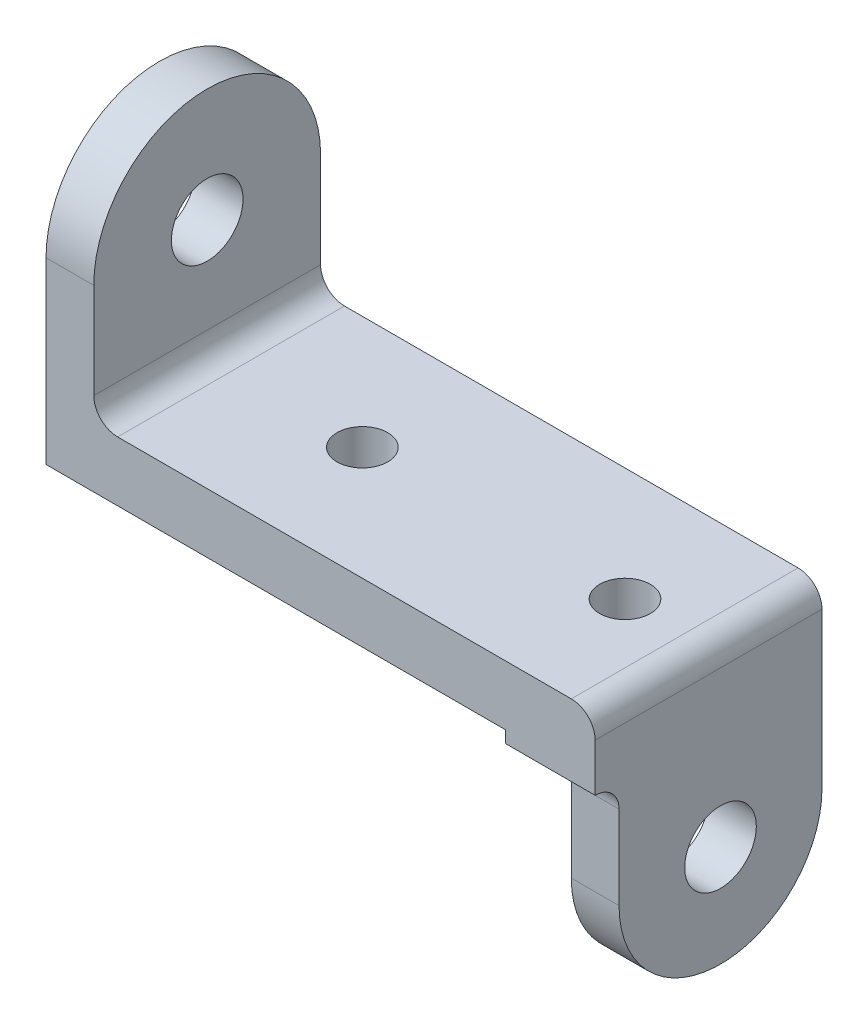
ISO-10303-21;
HEADER;
FILE_DESCRIPTION(('STEP AP214'),'2;1');
FILE_NAME('part.step','',(''),(''),'','','');
FILE_SCHEMA(('AUTOMOTIVE_DESIGN { 1 0 10303 214 1 1 1 1 }'));
ENDSEC;
DATA;
#1=APPLICATION_CONTEXT('core data for automotive mechanical design processes');
#2=APPLICATION_PROTOCOL_DEFINITION('international standard','automotive_design',2000,#1);
#3=PRODUCT_CONTEXT('',#1,'mechanical');
#4=PRODUCT('Part','Part','',(#3));
#5=PRODUCT_RELATED_PRODUCT_CATEGORY('part','',(#4));
#6=PRODUCT_DEFINITION_FORMATION('','',#4);
#7=PRODUCT_DEFINITION_CONTEXT('part definition',#1,'design');
#8=PRODUCT_DEFINITION('design','',#6,#7);
#9=PRODUCT_DEFINITION_SHAPE('','',#8);
#10=(LENGTH_UNIT() NAMED_UNIT(*) SI_UNIT(.MILLI.,.METRE.));
#11=(NAMED_UNIT(*) PLANE_ANGLE_UNIT() SI_UNIT($,.RADIAN.));
#12=(NAMED_UNIT(*) SI_UNIT($,.STERADIAN.) SOLID_ANGLE_UNIT());
#13=UNCERTAINTY_MEASURE_WITH_UNIT(LENGTH_MEASURE(1.E-05),#10,'distance_accuracy_value','');
#14=(GEOMETRIC_REPRESENTATION_CONTEXT(3) GLOBAL_UNCERTAINTY_ASSIGNED_CONTEXT((#13)) GLOBAL_UNIT_ASSIGNED_CONTEXT((#10,
#11,#12)) REPRESENTATION_CONTEXT('',''));
#15=CARTESIAN_POINT('',(0.,0.,0.));
#16=DIRECTION('',(0.,0.,1.));
#17=DIRECTION('',(1.,0.,0.));
#18=AXIS2_PLACEMENT_3D('',#15,#16,#17);
#19=CARTESIAN_POINT('',(122.2375,0.,0.));
#20=DIRECTION('',(1.,0.,0.));
#21=DIRECTION('',(0.,0.,-1.));
#22=AXIS2_PLACEMENT_3D('',#19,#20,#21);
#23=PLANE('',#22);
#24=DIRECTION('',(0.,-0.00487811092438263,0.999988101946123));
#25=VECTOR('',#24,1.);
#26=CARTESIAN_POINT('',(122.2375,-5.0566552119598,-0.0246672185221924));
#27=LINE('',#26,#25);
#28=CARTESIAN_POINT('',(122.2375,-4.7625,-60.325));
#29=VERTEX_POINT('',#28);
#30=CARTESIAN_POINT('',(122.2375,-4.87764941655943,-36.7199511828625));
#31=VERTEX_POINT('',#30);
#32=EDGE_CURVE('E242',#29,#31,#27,.T.);
#33=ORIENTED_EDGE('',*,*,#32,.T.);
#34=DIRECTION('',(0.,1.,0.));
#35=VECTOR('',#34,1.);
#36=CARTESIAN_POINT('',(122.2375,-58.7375,-36.7199511828625));
#37=LINE('',#36,#35);
#38=CARTESIAN_POINT('',(122.2375,0.,-36.7199511828625));
#39=VERTEX_POINT('',#38);
#40=EDGE_CURVE('E11',#31,#39,#37,.T.);
#41=ORIENTED_EDGE('',*,*,#40,.T.);
#42=DIRECTION('',(0.,0.,-1.));
#43=VECTOR('',#42,1.);
#44=CARTESIAN_POINT('',(122.2375,0.,0.));
#45=LINE('',#44,#43);
#46=CARTESIAN_POINT('',(122.2375,0.,-60.325));
#47=VERTEX_POINT('',#46);
#48=EDGE_CURVE('E159',#39,#47,#45,.T.);
#49=ORIENTED_EDGE('',*,*,#48,.T.);
#50=DIRECTION('',(0.,-1.,0.));
#51=VECTOR('',#50,1.);
#52=CARTESIAN_POINT('',(122.2375,0.,-60.325));
#53=LINE('',#52,#51);
#54=EDGE_CURVE('E181',#47,#29,#53,.T.);
#55=ORIENTED_EDGE('',*,*,#54,.T.);
#56=EDGE_LOOP('',(#33,#41,#49,#55));
#57=FACE_BOUND('',#56,.T.);
#58=ADVANCED_FACE('F34',(#57),#23,.F.);
#59=CARTESIAN_POINT('',(146.05,-5.0566552119598,-0.0246672185221924));
#60=DIRECTION('',(0.,-0.999988101946123,-0.00487811092438263));
#61=DIRECTION('',(0.,0.00487811092438263,-0.999988101946123));
#62=AXIS2_PLACEMENT_3D('',#59,#60,#61);
#63=PLANE('',#62);
#64=CARTESIAN_POINT('',(123.825,-4.90963777140983,-30.1625));
#65=DIRECTION('',(0.,-0.999988101946123,-0.00487811092438263));
#66=DIRECTION('',(0.,0.00487811092438263,-0.999988101946123));
#67=AXIS2_PLACEMENT_3D('',#64,#65,#66);
#68=ELLIPSE('',#67,6.74695527563738,6.74687500000001);
#69=CARTESIAN_POINT('',(122.2375,-4.94162612626022,-23.6050488171375));
#70=VERTEX_POINT('',#69);
#71=EDGE_CURVE('E49',#31,#70,#68,.T.);
#72=ORIENTED_EDGE('',*,*,#71,.F.);
#73=ORIENTED_EDGE('',*,*,#32,.F.);
#74=DIRECTION('',(-1.,0.,0.));
#75=VECTOR('',#74,1.);
#76=CARTESIAN_POINT('',(146.05,-4.7625,-60.325));
#77=LINE('',#76,#75);
#78=CARTESIAN_POINT('',(133.35,-4.7625,-60.325));
#79=VERTEX_POINT('',#78);
#80=EDGE_CURVE('E255',#79,#29,#77,.T.);
#81=ORIENTED_EDGE('',*,*,#80,.F.);
#82=DIRECTION('',(0.,-0.00487811092438263,0.999988101946123));
#83=VECTOR('',#82,1.);
#84=CARTESIAN_POINT('',(133.35,-5.0566552119598,-0.0246672185221924));
#85=LINE('',#84,#83);
#86=CARTESIAN_POINT('',(133.35,-5.03487193946542,-4.49012806053458));
#87=VERTEX_POINT('',#86);
#88=EDGE_CURVE('E208',#79,#87,#85,.T.);
#89=ORIENTED_EDGE('',*,*,#88,.T.);
#90=DIRECTION('',(-1.,0.,0.));
#91=VECTOR('',#90,1.);
#92=CARTESIAN_POINT('',(146.05,-5.03487193946542,-4.49012806053458));
#93=LINE('',#92,#91);
#94=CARTESIAN_POINT('',(122.2375,-5.03487193946542,-4.49012806053458));
#95=VERTEX_POINT('',#94);
#96=EDGE_CURVE('E170',#87,#95,#93,.T.);
#97=ORIENTED_EDGE('',*,*,#96,.T.);
#98=EDGE_CURVE('E241',#70,#95,#27,.T.);
#99=ORIENTED_EDGE('',*,*,#98,.F.);
#100=EDGE_LOOP('',(#72,#73,#81,#89,#97,#99));
#101=FACE_BOUND('',#100,.T.);
#102=ADVANCED_FACE('F298',(#101),#63,.T.);
#103=CARTESIAN_POINT('',(12.7,0.,-60.325));
#104=DIRECTION('',(0.,0.,1.));
#105=DIRECTION('',(1.,0.,0.));
#106=AXIS2_PLACEMENT_3D('',#103,#104,#105);
#107=PLANE('',#106);
#108=DIRECTION('',(-1.,0.,0.));
#109=VECTOR('',#108,1.);
#110=CARTESIAN_POINT('',(122.2375,15.875,-60.325));
#111=LINE('',#110,#109);
#112=CARTESIAN_POINT('',(139.7,15.875,-60.325));
#113=VERTEX_POINT('',#112);
#114=CARTESIAN_POINT('',(19.05,15.875,-60.325));
#115=VERTEX_POINT('',#114);
#116=EDGE_CURVE('E168',#113,#115,#111,.T.);
#117=ORIENTED_EDGE('',*,*,#116,.F.);
#118=CARTESIAN_POINT('',(139.7,9.525,-60.325));
#119=DIRECTION('',(0.,0.,1.));
#120=DIRECTION('',(1.,0.,0.));
#121=AXIS2_PLACEMENT_3D('',#118,#119,#120);
#122=CIRCLE('',#121,6.35);
#123=CARTESIAN_POINT('',(146.05,9.525,-60.325));
#124=VERTEX_POINT('',#123);
#125=EDGE_CURVE('E193',#113,#124,#122,.F.);
#126=ORIENTED_EDGE('',*,*,#125,.T.);
#127=DIRECTION('',(0.,-1.,0.));
#128=VECTOR('',#127,1.);
#129=CARTESIAN_POINT('',(146.05,0.,-60.325));
#130=LINE('',#129,#128);
#131=CARTESIAN_POINT('',(146.05,-31.75,-60.325));
#132=VERTEX_POINT('',#131);
#133=EDGE_CURVE('E235',#124,#132,#130,.T.);
#134=ORIENTED_EDGE('',*,*,#133,.T.);
#135=DIRECTION('',(-1.,0.,0.));
#136=VECTOR('',#135,1.);
#137=CARTESIAN_POINT('',(146.05,-31.75,-60.325));
#138=LINE('',#137,#136);
#139=CARTESIAN_POINT('',(133.35,-31.75,-60.325));
#140=VERTEX_POINT('',#139);
#141=EDGE_CURVE('E223',#132,#140,#138,.T.);
#142=ORIENTED_EDGE('',*,*,#141,.T.);
#143=DIRECTION('',(0.,-1.,0.));
#144=VECTOR('',#143,1.);
#145=CARTESIAN_POINT('',(133.35,0.,-60.325));
#146=LINE('',#145,#144);
#147=EDGE_CURVE('E205',#79,#140,#146,.T.);
#148=ORIENTED_EDGE('',*,*,#147,.F.);
#149=ORIENTED_EDGE('',*,*,#80,.T.);
#150=ORIENTED_EDGE('',*,*,#54,.F.);
#151=DIRECTION('',(-1.,0.,0.));
#152=VECTOR('',#151,1.);
#153=CARTESIAN_POINT('',(12.7,0.,-60.325));
#154=LINE('',#153,#152);
#155=CARTESIAN_POINT('',(0.,0.,-60.325));
#156=VERTEX_POINT('',#155);
#157=EDGE_CURVE('E177',#47,#156,#154,.T.);
#158=ORIENTED_EDGE('',*,*,#157,.T.);
#159=DIRECTION('',(0.,1.,0.));
#160=VECTOR('',#159,1.);
#161=CARTESIAN_POINT('',(0.,0.,-60.325));
#162=LINE('',#161,#160);
#163=CARTESIAN_POINT('',(0.,47.625,-60.325));
#164=VERTEX_POINT('',#163);
#165=EDGE_CURVE('E368',#156,#164,#162,.T.);
#166=ORIENTED_EDGE('',*,*,#165,.T.);
#167=DIRECTION('',(-1.,0.,0.));
#168=VECTOR('',#167,1.);
#169=CARTESIAN_POINT('',(12.7,47.625,-60.325));
#170=LINE('',#169,#168);
#171=CARTESIAN_POINT('',(12.7,47.625,-60.325));
#172=VERTEX_POINT('',#171);
#173=EDGE_CURVE('E175',#172,#164,#170,.T.);
#174=ORIENTED_EDGE('',*,*,#173,.F.);
#175=DIRECTION('',(0.,1.,0.));
#176=VECTOR('',#175,1.);
#177=CARTESIAN_POINT('',(12.7,0.,-60.325));
#178=LINE('',#177,#176);
#179=CARTESIAN_POINT('',(12.7,22.225,-60.325));
#180=VERTEX_POINT('',#179);
#181=EDGE_CURVE('E362',#180,#172,#178,.T.);
#182=ORIENTED_EDGE('',*,*,#181,.F.);
#183=CARTESIAN_POINT('',(19.05,22.225,-60.325));
#184=DIRECTION('',(0.,0.,1.));
#185=DIRECTION('',(1.,0.,0.));
#186=AXIS2_PLACEMENT_3D('',#183,#184,#185);
#187=CIRCLE('',#186,6.35);
#188=EDGE_CURVE('E151',#180,#115,#187,.T.);
#189=ORIENTED_EDGE('',*,*,#188,.T.);
#190=EDGE_LOOP('',(#117,#126,#134,#142,#148,#149,#150,#158,#166,#174,#182,#189));
#191=FACE_BOUND('',#190,.T.);
#192=ADVANCED_FACE('F304',(#191),#107,.F.);
#193=CARTESIAN_POINT('',(12.7,47.625,-30.1625));
#194=DIRECTION('',(-1.,0.,0.));
#195=DIRECTION('',(0.,0.,1.));
#196=AXIS2_PLACEMENT_3D('',#193,#194,#195);
#197=CYLINDRICAL_SURFACE('',#196,30.1625);
#198=CARTESIAN_POINT('',(0.,47.625,-30.1625));
#199=DIRECTION('',(1.,0.,0.));
#200=DIRECTION('',(0.,0.,-1.));
#201=AXIS2_PLACEMENT_3D('',#198,#199,#200);
#202=CIRCLE('',#201,30.1625);
#203=CARTESIAN_POINT('',(0.,47.625,0.));
#204=VERTEX_POINT('',#203);
#205=EDGE_CURVE('E382',#164,#204,#202,.T.);
#206=ORIENTED_EDGE('',*,*,#205,.T.);
#207=DIRECTION('',(-1.,0.,0.));
#208=VECTOR('',#207,1.);
#209=CARTESIAN_POINT('',(12.7,47.625,0.));
#210=LINE('',#209,#208);
#211=CARTESIAN_POINT('',(12.7,47.625,0.));
#212=VERTEX_POINT('',#211);
#213=EDGE_CURVE('E387',#212,#204,#210,.T.);
#214=ORIENTED_EDGE('',*,*,#213,.F.);
#215=CARTESIAN_POINT('',(12.7,47.625,-30.1625));
#216=DIRECTION('',(1.,0.,0.));
#217=DIRECTION('',(0.,0.,-1.));
#218=AXIS2_PLACEMENT_3D('',#215,#216,#217);
#219=CIRCLE('',#218,30.1625);
#220=EDGE_CURVE('E376',#172,#212,#219,.T.);
#221=ORIENTED_EDGE('',*,*,#220,.F.);
#222=ORIENTED_EDGE('',*,*,#173,.T.);
#223=EDGE_LOOP('',(#206,#214,#221,#222));
#224=FACE_BOUND('',#223,.T.);
#225=ADVANCED_FACE('F334',(#224),#197,.T.);
#226=CARTESIAN_POINT('',(12.7,0.,0.));
#227=DIRECTION('',(0.,0.,1.));
#228=DIRECTION('',(0.,-1.,0.));
#229=AXIS2_PLACEMENT_3D('',#226,#227,#228);
#230=PLANE('',#229);
#231=DIRECTION('',(0.,-1.,0.));
#232=VECTOR('',#231,1.);
#233=CARTESIAN_POINT('',(146.05,0.,0.));
#234=LINE('',#233,#232);
#235=CARTESIAN_POINT('',(146.05,9.525,0.));
#236=VERTEX_POINT('',#235);
#237=CARTESIAN_POINT('',(146.05,-3.175,0.));
#238=VERTEX_POINT('',#237);
#239=EDGE_CURVE('E237',#236,#238,#234,.T.);
#240=ORIENTED_EDGE('',*,*,#239,.F.);
#241=CARTESIAN_POINT('',(139.7,9.525,0.));
#242=DIRECTION('',(0.,0.,1.));
#243=DIRECTION('',(0.,-1.,0.));
#244=AXIS2_PLACEMENT_3D('',#241,#242,#243);
#245=CIRCLE('',#244,6.35);
#246=CARTESIAN_POINT('',(139.7,15.875,0.));
#247=VERTEX_POINT('',#246);
#248=EDGE_CURVE('E190',#236,#247,#245,.T.);
#249=ORIENTED_EDGE('',*,*,#248,.T.);
#250=DIRECTION('',(-1.,0.,0.));
#251=VECTOR('',#250,1.);
#252=CARTESIAN_POINT('',(122.2375,15.875,0.));
#253=LINE('',#252,#251);
#254=CARTESIAN_POINT('',(19.05,15.875,0.));
#255=VERTEX_POINT('',#254);
#256=EDGE_CURVE('E165',#247,#255,#253,.T.);
#257=ORIENTED_EDGE('',*,*,#256,.T.);
#258=CARTESIAN_POINT('',(19.05,22.225,0.));
#259=DIRECTION('',(0.,0.,1.));
#260=DIRECTION('',(0.,-1.,0.));
#261=AXIS2_PLACEMENT_3D('',#258,#259,#260);
#262=CIRCLE('',#261,6.35);
#263=CARTESIAN_POINT('',(12.7,22.225,0.));
#264=VERTEX_POINT('',#263);
#265=EDGE_CURVE('E188',#255,#264,#262,.F.);
#266=ORIENTED_EDGE('',*,*,#265,.T.);
#267=DIRECTION('',(0.,1.,0.));
#268=VECTOR('',#267,1.);
#269=CARTESIAN_POINT('',(12.7,0.,0.));
#270=LINE('',#269,#268);
#271=EDGE_CURVE('E379',#264,#212,#270,.T.);
#272=ORIENTED_EDGE('',*,*,#271,.T.);
#273=ORIENTED_EDGE('',*,*,#213,.T.);
#274=DIRECTION('',(0.,1.,0.));
#275=VECTOR('',#274,1.);
#276=CARTESIAN_POINT('',(0.,0.,0.));
#277=LINE('',#276,#275);
#278=CARTESIAN_POINT('',(0.,0.,0.));
#279=VERTEX_POINT('',#278);
#280=EDGE_CURVE('E385',#279,#204,#277,.T.);
#281=ORIENTED_EDGE('',*,*,#280,.F.);
#282=DIRECTION('',(-1.,0.,0.));
#283=VECTOR('',#282,1.);
#284=CARTESIAN_POINT('',(12.7,0.,0.));
#285=LINE('',#284,#283);
#286=CARTESIAN_POINT('',(122.2375,0.,0.));
#287=VERTEX_POINT('',#286);
#288=EDGE_CURVE('E389',#287,#279,#285,.T.);
#289=ORIENTED_EDGE('',*,*,#288,.F.);
#290=DIRECTION('',(0.,-1.,0.));
#291=VECTOR('',#290,1.);
#292=CARTESIAN_POINT('',(122.2375,0.,0.));
#293=LINE('',#292,#291);
#294=CARTESIAN_POINT('',(122.2375,-3.175,0.));
#295=VERTEX_POINT('',#294);
#296=EDGE_CURVE('E164',#287,#295,#293,.T.);
#297=ORIENTED_EDGE('',*,*,#296,.T.);
#298=DIRECTION('',(-1.,0.,0.));
#299=VECTOR('',#298,1.);
#300=CARTESIAN_POINT('',(146.05,-3.175,0.));
#301=LINE('',#300,#299);
#302=EDGE_CURVE('E239',#238,#295,#301,.T.);
#303=ORIENTED_EDGE('',*,*,#302,.F.);
#304=EDGE_LOOP('',(#240,#249,#257,#266,#272,#273,#281,#289,#297,#303));
#305=FACE_BOUND('',#304,.T.);
#306=ADVANCED_FACE('F331',(#305),#230,.T.);
#307=CARTESIAN_POINT('',(12.7,47.625,-30.1625));
#308=DIRECTION('',(-1.,0.,0.));
#309=DIRECTION('',(0.,0.,1.));
#310=AXIS2_PLACEMENT_3D('',#307,#308,#309);
#311=CYLINDRICAL_SURFACE('',#310,9.52500000000001);
#312=CARTESIAN_POINT('',(12.7,47.625,-30.1625));
#313=DIRECTION('',(1.,0.,0.));
#314=DIRECTION('',(0.,0.,-1.));
#315=AXIS2_PLACEMENT_3D('',#312,#313,#314);
#316=CIRCLE('',#315,9.52500000000001);
#317=CARTESIAN_POINT('',(12.7,47.625,-39.6875));
#318=VERTEX_POINT('',#317);
#319=EDGE_CURVE('E371',#318,#318,#316,.T.);
#320=ORIENTED_EDGE('',*,*,#319,.T.);
#321=EDGE_LOOP('',(#320));
#322=FACE_BOUND('',#321,.T.);
#323=CARTESIAN_POINT('',(0.,47.625,-30.1625));
#324=DIRECTION('',(1.,0.,0.));
#325=DIRECTION('',(0.,0.,-1.));
#326=AXIS2_PLACEMENT_3D('',#323,#324,#325);
#327=CIRCLE('',#326,9.52500000000001);
#328=CARTESIAN_POINT('',(0.,47.625,-39.6875));
#329=VERTEX_POINT('',#328);
#330=EDGE_CURVE('E366',#329,#329,#327,.T.);
#331=ORIENTED_EDGE('',*,*,#330,.F.);
#332=EDGE_LOOP('',(#331));
#333=FACE_BOUND('',#332,.T.);
#334=ADVANCED_FACE('F330',(#322,#333),#311,.F.);
#335=CARTESIAN_POINT('',(12.7,0.,0.));
#336=DIRECTION('',(0.,1.,0.));
#337=DIRECTION('',(0.,0.,1.));
#338=AXIS2_PLACEMENT_3D('',#335,#336,#337);
#339=PLANE('',#338);
#340=CARTESIAN_POINT('',(53.975,0.,-30.1625));
#341=DIRECTION('',(0.,1.,0.));
#342=DIRECTION('',(0.,0.,1.));
#343=AXIS2_PLACEMENT_3D('',#340,#341,#342);
#344=CIRCLE('',#343,6.746875);
#345=CARTESIAN_POINT('',(53.975,0.,-23.415625));
#346=VERTEX_POINT('',#345);
#347=EDGE_CURVE('E259',#346,#346,#344,.T.);
#348=ORIENTED_EDGE('',*,*,#347,.T.);
#349=EDGE_LOOP('',(#348));
#350=FACE_BOUND('',#349,.T.);
#351=ORIENTED_EDGE('',*,*,#48,.F.);
#352=CARTESIAN_POINT('',(123.825,0.,-30.1625));
#353=DIRECTION('',(0.,1.,0.));
#354=DIRECTION('',(0.,0.,1.));
#355=AXIS2_PLACEMENT_3D('',#352,#353,#354);
#356=CIRCLE('',#355,6.74687500000001);
#357=CARTESIAN_POINT('',(122.2375,0.,-23.6050488171375));
#358=VERTEX_POINT('',#357);
#359=EDGE_CURVE('E147',#39,#358,#356,.T.);
#360=ORIENTED_EDGE('',*,*,#359,.T.);
#361=EDGE_CURVE('E156',#287,#358,#45,.T.);
#362=ORIENTED_EDGE('',*,*,#361,.F.);
#363=ORIENTED_EDGE('',*,*,#288,.T.);
#364=DIRECTION('',(0.,0.,-1.));
#365=VECTOR('',#364,1.);
#366=CARTESIAN_POINT('',(0.,0.,0.));
#367=LINE('',#366,#365);
#368=EDGE_CURVE('E374',#279,#156,#367,.T.);
#369=ORIENTED_EDGE('',*,*,#368,.T.);
#370=ORIENTED_EDGE('',*,*,#157,.F.);
#371=EDGE_LOOP('',(#351,#360,#362,#363,#369,#370));
#372=FACE_BOUND('',#371,.T.);
#373=ADVANCED_FACE('F155',(#350,#372),#339,.F.);
#374=CARTESIAN_POINT('',(12.7,0.,0.));
#375=DIRECTION('',(1.,0.,0.));
#376=DIRECTION('',(0.,0.,-1.));
#377=AXIS2_PLACEMENT_3D('',#374,#375,#376);
#378=PLANE('',#377);
#379=ORIENTED_EDGE('',*,*,#271,.F.);
#380=DIRECTION('',(0.,0.,1.));
#381=VECTOR('',#380,1.);
#382=CARTESIAN_POINT('',(12.7,22.225,-60.325));
#383=LINE('',#382,#381);
#384=EDGE_CURVE('E195',#264,#180,#383,.F.);
#385=ORIENTED_EDGE('',*,*,#384,.T.);
#386=ORIENTED_EDGE('',*,*,#181,.T.);
#387=ORIENTED_EDGE('',*,*,#220,.T.);
#388=EDGE_LOOP('',(#379,#385,#386,#387));
#389=FACE_BOUND('',#388,.T.);
#390=ORIENTED_EDGE('',*,*,#319,.F.);
#391=EDGE_LOOP('',(#390));
#392=FACE_BOUND('',#391,.T.);
#393=ADVANCED_FACE('F320',(#389,#392),#378,.T.);
#394=CARTESIAN_POINT('',(0.,0.,0.));
#395=DIRECTION('',(1.,0.,0.));
#396=DIRECTION('',(0.,0.,-1.));
#397=AXIS2_PLACEMENT_3D('',#394,#395,#396);
#398=PLANE('',#397);
#399=ORIENTED_EDGE('',*,*,#330,.T.);
#400=EDGE_LOOP('',(#399));
#401=FACE_BOUND('',#400,.T.);
#402=ORIENTED_EDGE('',*,*,#205,.F.);
#403=ORIENTED_EDGE('',*,*,#165,.F.);
#404=ORIENTED_EDGE('',*,*,#368,.F.);
#405=ORIENTED_EDGE('',*,*,#280,.T.);
#406=EDGE_LOOP('',(#402,#403,#404,#405));
#407=FACE_BOUND('',#406,.T.);
#408=ADVANCED_FACE('F313',(#401,#407),#398,.F.);
#409=CARTESIAN_POINT('',(122.2375,15.875,0.));
#410=DIRECTION('',(0.,1.,0.));
#411=DIRECTION('',(0.,0.,1.));
#412=AXIS2_PLACEMENT_3D('',#409,#410,#411);
#413=PLANE('',#412);
#414=CARTESIAN_POINT('',(123.825,15.875,-30.1625));
#415=DIRECTION('',(0.,1.,0.));
#416=DIRECTION('',(0.,0.,1.));
#417=AXIS2_PLACEMENT_3D('',#414,#415,#416);
#418=CIRCLE('',#417,6.74687500000001);
#419=CARTESIAN_POINT('',(123.825,15.875,-23.415625));
#420=VERTEX_POINT('',#419);
#421=EDGE_CURVE('E160',#420,#420,#418,.T.);
#422=ORIENTED_EDGE('',*,*,#421,.F.);
#423=EDGE_LOOP('',(#422));
#424=FACE_BOUND('',#423,.T.);
#425=CARTESIAN_POINT('',(53.975,15.875,-30.1625));
#426=DIRECTION('',(0.,1.,0.));
#427=DIRECTION('',(0.,0.,1.));
#428=AXIS2_PLACEMENT_3D('',#425,#426,#427);
#429=CIRCLE('',#428,6.746875);
#430=CARTESIAN_POINT('',(53.975,15.875,-23.415625));
#431=VERTEX_POINT('',#430);
#432=EDGE_CURVE('E264',#431,#431,#429,.T.);
#433=ORIENTED_EDGE('',*,*,#432,.F.);
#434=EDGE_LOOP('',(#433));
#435=FACE_BOUND('',#434,.T.);
#436=ORIENTED_EDGE('',*,*,#116,.T.);
#437=DIRECTION('',(0.,0.,1.));
#438=VECTOR('',#437,1.);
#439=CARTESIAN_POINT('',(19.05,15.875,0.));
#440=LINE('',#439,#438);
#441=EDGE_CURVE('E197',#115,#255,#440,.T.);
#442=ORIENTED_EDGE('',*,*,#441,.T.);
#443=ORIENTED_EDGE('',*,*,#256,.F.);
#444=DIRECTION('',(0.,0.,-1.));
#445=VECTOR('',#444,1.);
#446=CARTESIAN_POINT('',(139.7,15.875,0.));
#447=LINE('',#446,#445);
#448=EDGE_CURVE('E200',#247,#113,#447,.T.);
#449=ORIENTED_EDGE('',*,*,#448,.T.);
#450=EDGE_LOOP('',(#436,#442,#443,#449));
#451=FACE_BOUND('',#450,.T.);
#452=ADVANCED_FACE('F308',(#424,#435,#451),#413,.T.);
#453=ORIENTED_EDGE('',*,*,#361,.T.);
#454=DIRECTION('',(0.,1.,0.));
#455=VECTOR('',#454,1.);
#456=CARTESIAN_POINT('',(122.2375,-58.7375,-23.6050488171375));
#457=LINE('',#456,#455);
#458=EDGE_CURVE('E42',#358,#70,#457,.F.);
#459=ORIENTED_EDGE('',*,*,#458,.T.);
#460=ORIENTED_EDGE('',*,*,#98,.T.);
#461=CARTESIAN_POINT('',(122.2375,-9.525,0.));
#462=DIRECTION('',(1.,0.,0.));
#463=DIRECTION('',(0.,0.,-1.));
#464=AXIS2_PLACEMENT_3D('',#461,#462,#463);
#465=CIRCLE('',#464,6.35);
#466=EDGE_CURVE('E231',#95,#295,#465,.T.);
#467=ORIENTED_EDGE('',*,*,#466,.T.);
#468=ORIENTED_EDGE('',*,*,#296,.F.);
#469=EDGE_LOOP('',(#453,#459,#460,#467,#468));
#470=FACE_BOUND('',#469,.T.);
#471=ADVANCED_FACE('F162',(#470),#23,.F.);
#472=CARTESIAN_POINT('',(146.05,-9.525,0.));
#473=DIRECTION('',(-1.,0.,0.));
#474=DIRECTION('',(0.,0.,1.));
#475=AXIS2_PLACEMENT_3D('',#472,#473,#474);
#476=CYLINDRICAL_SURFACE('',#475,6.35);
#477=ORIENTED_EDGE('',*,*,#466,.F.);
#478=ORIENTED_EDGE('',*,*,#96,.F.);
#479=CARTESIAN_POINT('',(133.35,-9.525,0.));
#480=DIRECTION('',(1.,0.,0.));
#481=DIRECTION('',(0.,0.,-1.));
#482=AXIS2_PLACEMENT_3D('',#479,#480,#481);
#483=CIRCLE('',#482,6.35);
#484=CARTESIAN_POINT('',(133.35,-9.525,-6.35));
#485=VERTEX_POINT('',#484);
#486=EDGE_CURVE('E257',#485,#87,#483,.T.);
#487=ORIENTED_EDGE('',*,*,#486,.F.);
#488=DIRECTION('',(-1.,0.,0.));
#489=VECTOR('',#488,1.);
#490=CARTESIAN_POINT('',(146.05,-9.525,-6.35));
#491=LINE('',#490,#489);
#492=CARTESIAN_POINT('',(146.05,-9.525,-6.35));
#493=VERTEX_POINT('',#492);
#494=EDGE_CURVE('E229',#493,#485,#491,.T.);
#495=ORIENTED_EDGE('',*,*,#494,.F.);
#496=CARTESIAN_POINT('',(146.05,-9.525,0.));
#497=DIRECTION('',(1.,0.,0.));
#498=DIRECTION('',(0.,0.,-1.));
#499=AXIS2_PLACEMENT_3D('',#496,#497,#498);
#500=CIRCLE('',#499,6.35);
#501=EDGE_CURVE('E232',#493,#238,#500,.T.);
#502=ORIENTED_EDGE('',*,*,#501,.T.);
#503=ORIENTED_EDGE('',*,*,#302,.T.);
#504=EDGE_LOOP('',(#477,#478,#487,#495,#502,#503));
#505=FACE_BOUND('',#504,.T.);
#506=ADVANCED_FACE('F285',(#505),#476,.F.);
#507=CARTESIAN_POINT('',(146.05,0.,0.));
#508=DIRECTION('',(1.,0.,0.));
#509=DIRECTION('',(0.,0.,-1.));
#510=AXIS2_PLACEMENT_3D('',#507,#508,#509);
#511=PLANE('',#510);
#512=ORIENTED_EDGE('',*,*,#133,.F.);
#513=DIRECTION('',(0.,0.,-1.));
#514=VECTOR('',#513,1.);
#515=CARTESIAN_POINT('',(146.05,9.525,0.));
#516=LINE('',#515,#514);
#517=EDGE_CURVE('E57',#124,#236,#516,.F.);
#518=ORIENTED_EDGE('',*,*,#517,.T.);
#519=ORIENTED_EDGE('',*,*,#239,.T.);
#520=ORIENTED_EDGE('',*,*,#501,.F.);
#521=DIRECTION('',(0.,-1.,0.));
#522=VECTOR('',#521,1.);
#523=CARTESIAN_POINT('',(146.05,0.,-6.35));
#524=LINE('',#523,#522);
#525=CARTESIAN_POINT('',(146.05,-31.75,-6.35));
#526=VERTEX_POINT('',#525);
#527=EDGE_CURVE('E222',#493,#526,#524,.T.);
#528=ORIENTED_EDGE('',*,*,#527,.T.);
#529=CARTESIAN_POINT('',(146.05,-31.75,-33.3375));
#530=DIRECTION('',(1.,0.,0.));
#531=DIRECTION('',(0.,0.,-1.));
#532=AXIS2_PLACEMENT_3D('',#529,#530,#531);
#533=CIRCLE('',#532,26.9875);
#534=EDGE_CURVE('E273',#526,#132,#533,.T.);
#535=ORIENTED_EDGE('',*,*,#534,.T.);
#536=EDGE_LOOP('',(#512,#518,#519,#520,#528,#535));
#537=FACE_BOUND('',#536,.T.);
#538=CARTESIAN_POINT('',(146.05,-31.75,-33.3375));
#539=DIRECTION('',(1.,0.,0.));
#540=DIRECTION('',(0.,0.,-1.));
#541=AXIS2_PLACEMENT_3D('',#538,#539,#540);
#542=CIRCLE('',#541,9.525);
#543=CARTESIAN_POINT('',(146.05,-31.75,-42.8625));
#544=VERTEX_POINT('',#543);
#545=EDGE_CURVE('E226',#544,#544,#542,.T.);
#546=ORIENTED_EDGE('',*,*,#545,.F.);
#547=EDGE_LOOP('',(#546));
#548=FACE_BOUND('',#547,.T.);
#549=ADVANCED_FACE('F282',(#537,#548),#511,.T.);
#550=CARTESIAN_POINT('',(146.05,0.,-6.35));
#551=DIRECTION('',(0.,0.,-1.));
#552=DIRECTION('',(-1.,0.,0.));
#553=AXIS2_PLACEMENT_3D('',#550,#551,#552);
#554=PLANE('',#553);
#555=DIRECTION('',(0.,-1.,0.));
#556=VECTOR('',#555,1.);
#557=CARTESIAN_POINT('',(133.35,0.,-6.35));
#558=LINE('',#557,#556);
#559=CARTESIAN_POINT('',(133.35,-31.75,-6.35));
#560=VERTEX_POINT('',#559);
#561=EDGE_CURVE('E258',#485,#560,#558,.T.);
#562=ORIENTED_EDGE('',*,*,#561,.T.);
#563=DIRECTION('',(-1.,0.,0.));
#564=VECTOR('',#563,1.);
#565=CARTESIAN_POINT('',(146.05,-31.75,-6.35));
#566=LINE('',#565,#564);
#567=EDGE_CURVE('E225',#526,#560,#566,.T.);
#568=ORIENTED_EDGE('',*,*,#567,.F.);
#569=ORIENTED_EDGE('',*,*,#527,.F.);
#570=ORIENTED_EDGE('',*,*,#494,.T.);
#571=EDGE_LOOP('',(#562,#568,#569,#570));
#572=FACE_BOUND('',#571,.T.);
#573=ADVANCED_FACE('F284',(#572),#554,.F.);
#574=CARTESIAN_POINT('',(146.05,-31.75,-33.3375));
#575=DIRECTION('',(-1.,0.,0.));
#576=DIRECTION('',(0.,0.,1.));
#577=AXIS2_PLACEMENT_3D('',#574,#575,#576);
#578=CYLINDRICAL_SURFACE('',#577,26.9875);
#579=CARTESIAN_POINT('',(133.35,-31.75,-33.3375));
#580=DIRECTION('',(1.,0.,0.));
#581=DIRECTION('',(0.,0.,-1.));
#582=AXIS2_PLACEMENT_3D('',#579,#580,#581);
#583=CIRCLE('',#582,26.9875);
#584=EDGE_CURVE('E209',#560,#140,#583,.T.);
#585=ORIENTED_EDGE('',*,*,#584,.T.);
#586=ORIENTED_EDGE('',*,*,#141,.F.);
#587=ORIENTED_EDGE('',*,*,#534,.F.);
#588=ORIENTED_EDGE('',*,*,#567,.T.);
#589=EDGE_LOOP('',(#585,#586,#587,#588));
#590=FACE_BOUND('',#589,.T.);
#591=ADVANCED_FACE('F291',(#590),#578,.T.);
#592=CARTESIAN_POINT('',(146.05,-31.75,-33.3375));
#593=DIRECTION('',(-1.,0.,0.));
#594=DIRECTION('',(0.,0.,1.));
#595=AXIS2_PLACEMENT_3D('',#592,#593,#594);
#596=CYLINDRICAL_SURFACE('',#595,9.525);
#597=ORIENTED_EDGE('',*,*,#545,.T.);
#598=EDGE_LOOP('',(#597));
#599=FACE_BOUND('',#598,.T.);
#600=CARTESIAN_POINT('',(133.35,-31.75,-33.3375));
#601=DIRECTION('',(1.,0.,0.));
#602=DIRECTION('',(0.,0.,-1.));
#603=AXIS2_PLACEMENT_3D('',#600,#601,#602);
#604=CIRCLE('',#603,9.525);
#605=CARTESIAN_POINT('',(133.35,-31.75,-42.8625));
#606=VERTEX_POINT('',#605);
#607=EDGE_CURVE('E213',#606,#606,#604,.T.);
#608=ORIENTED_EDGE('',*,*,#607,.F.);
#609=EDGE_LOOP('',(#608));
#610=FACE_BOUND('',#609,.T.);
#611=ADVANCED_FACE('F279',(#599,#610),#596,.F.);
#612=CARTESIAN_POINT('',(133.35,0.,0.));
#613=DIRECTION('',(1.,0.,0.));
#614=DIRECTION('',(0.,0.,-1.));
#615=AXIS2_PLACEMENT_3D('',#612,#613,#614);
#616=PLANE('',#615);
#617=ORIENTED_EDGE('',*,*,#486,.T.);
#618=ORIENTED_EDGE('',*,*,#88,.F.);
#619=ORIENTED_EDGE('',*,*,#147,.T.);
#620=ORIENTED_EDGE('',*,*,#584,.F.);
#621=ORIENTED_EDGE('',*,*,#561,.F.);
#622=EDGE_LOOP('',(#617,#618,#619,#620,#621));
#623=FACE_BOUND('',#622,.T.);
#624=ORIENTED_EDGE('',*,*,#607,.T.);
#625=EDGE_LOOP('',(#624));
#626=FACE_BOUND('',#625,.T.);
#627=ADVANCED_FACE('F346',(#623,#626),#616,.F.);
#628=CARTESIAN_POINT('',(19.05,22.225,0.));
#629=DIRECTION('',(0.,0.,-1.));
#630=DIRECTION('',(-1.,0.,0.));
#631=AXIS2_PLACEMENT_3D('',#628,#629,#630);
#632=CYLINDRICAL_SURFACE('',#631,6.35);
#633=ORIENTED_EDGE('',*,*,#188,.F.);
#634=ORIENTED_EDGE('',*,*,#384,.F.);
#635=ORIENTED_EDGE('',*,*,#265,.F.);
#636=ORIENTED_EDGE('',*,*,#441,.F.);
#637=EDGE_LOOP('',(#633,#634,#635,#636));
#638=FACE_BOUND('',#637,.T.);
#639=ADVANCED_FACE('F344',(#638),#632,.F.);
#640=CARTESIAN_POINT('',(139.7,9.525,0.));
#641=DIRECTION('',(0.,0.,-1.));
#642=DIRECTION('',(-1.,0.,0.));
#643=AXIS2_PLACEMENT_3D('',#640,#641,#642);
#644=CYLINDRICAL_SURFACE('',#643,6.35);
#645=ORIENTED_EDGE('',*,*,#248,.F.);
#646=ORIENTED_EDGE('',*,*,#517,.F.);
#647=ORIENTED_EDGE('',*,*,#125,.F.);
#648=ORIENTED_EDGE('',*,*,#448,.F.);
#649=EDGE_LOOP('',(#645,#646,#647,#648));
#650=FACE_BOUND('',#649,.T.);
#651=ADVANCED_FACE('F36',(#650),#644,.T.);
#652=CARTESIAN_POINT('',(53.975,-58.7375,-30.1625));
#653=DIRECTION('',(0.,1.,0.));
#654=DIRECTION('',(0.,0.,1.));
#655=AXIS2_PLACEMENT_3D('',#652,#653,#654);
#656=CYLINDRICAL_SURFACE('',#655,6.746875);
#657=ORIENTED_EDGE('',*,*,#432,.T.);
#658=EDGE_LOOP('',(#657));
#659=FACE_BOUND('',#658,.T.);
#660=ORIENTED_EDGE('',*,*,#347,.F.);
#661=EDGE_LOOP('',(#660));
#662=FACE_BOUND('',#661,.T.);
#663=ADVANCED_FACE('F352',(#659,#662),#656,.F.);
#664=CARTESIAN_POINT('',(123.825,-58.7375,-30.1625));
#665=DIRECTION('',(0.,1.,0.));
#666=DIRECTION('',(0.,0.,1.));
#667=AXIS2_PLACEMENT_3D('',#664,#665,#666);
#668=CYLINDRICAL_SURFACE('',#667,6.74687500000001);
#669=ORIENTED_EDGE('',*,*,#421,.T.);
#670=EDGE_LOOP('',(#669));
#671=FACE_BOUND('',#670,.T.);
#672=ORIENTED_EDGE('',*,*,#71,.T.);
#673=ORIENTED_EDGE('',*,*,#458,.F.);
#674=ORIENTED_EDGE('',*,*,#359,.F.);
#675=ORIENTED_EDGE('',*,*,#40,.F.);
#676=EDGE_LOOP('',(#672,#673,#674,#675));
#677=FACE_BOUND('',#676,.T.);
#678=ADVANCED_FACE('F146',(#671,#677),#668,.F.);
#679=CLOSED_SHELL('',(#58,#102,#192,#225,#306,#334,#373,#393,#408,#452,#471,#506,#549,#573,#591,
#611,#627,#639,#651,#663,#678));
#680=MANIFOLD_SOLID_BREP('B2',#679);
#681=ADVANCED_BREP_SHAPE_REPRESENTATION('',(#18,#680),#14);
#682=SHAPE_DEFINITION_REPRESENTATION(#9,#681);
ENDSEC;
END-ISO-10303-21;
